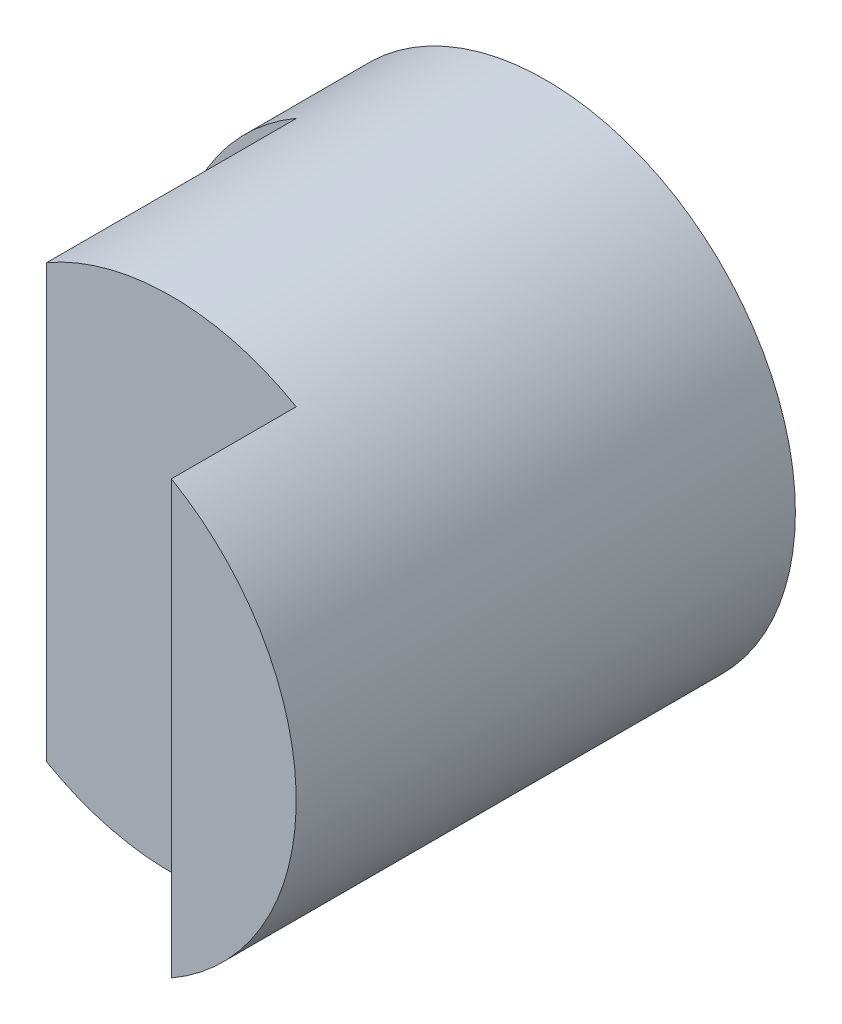
ISO-10303-21;
HEADER;
FILE_DESCRIPTION(('STEP AP214'),'2;1');
FILE_NAME('part.step','',(''),(''),'','','');
FILE_SCHEMA(('AUTOMOTIVE_DESIGN { 1 0 10303 214 1 1 1 1 }'));
ENDSEC;
DATA;
#1=APPLICATION_CONTEXT('core data for automotive mechanical design processes');
#2=APPLICATION_PROTOCOL_DEFINITION('international standard','automotive_design',2000,#1);
#3=PRODUCT_CONTEXT('',#1,'mechanical');
#4=PRODUCT('Part','Part','',(#3));
#5=PRODUCT_RELATED_PRODUCT_CATEGORY('part','',(#4));
#6=PRODUCT_DEFINITION_FORMATION('','',#4);
#7=PRODUCT_DEFINITION_CONTEXT('part definition',#1,'design');
#8=PRODUCT_DEFINITION('design','',#6,#7);
#9=PRODUCT_DEFINITION_SHAPE('','',#8);
#10=(LENGTH_UNIT() NAMED_UNIT(*) SI_UNIT(.MILLI.,.METRE.));
#11=(NAMED_UNIT(*) PLANE_ANGLE_UNIT() SI_UNIT($,.RADIAN.));
#12=(NAMED_UNIT(*) SI_UNIT($,.STERADIAN.) SOLID_ANGLE_UNIT());
#13=UNCERTAINTY_MEASURE_WITH_UNIT(LENGTH_MEASURE(1.E-05),#10,'distance_accuracy_value','');
#14=(GEOMETRIC_REPRESENTATION_CONTEXT(3) GLOBAL_UNCERTAINTY_ASSIGNED_CONTEXT((#13)) GLOBAL_UNIT_ASSIGNED_CONTEXT((#10,
#11,#12)) REPRESENTATION_CONTEXT('',''));
#15=CARTESIAN_POINT('',(0.,0.,0.));
#16=DIRECTION('',(0.,0.,1.));
#17=DIRECTION('',(1.,0.,0.));
#18=AXIS2_PLACEMENT_3D('',#15,#16,#17);
#19=CARTESIAN_POINT('',(0.,0.,4.));
#20=DIRECTION('',(0.,0.,-1.));
#21=DIRECTION('',(-1.,0.,0.));
#22=AXIS2_PLACEMENT_3D('',#19,#20,#21);
#23=CYLINDRICAL_SURFACE('',#22,2.);
#24=CARTESIAN_POINT('',(0.,0.,4.));
#25=DIRECTION('',(0.,0.,1.));
#26=DIRECTION('',(1.,0.,0.));
#27=AXIS2_PLACEMENT_3D('',#24,#25,#26);
#28=CIRCLE('',#27,2.);
#29=CARTESIAN_POINT('',(1.,-1.73205080756888,4.));
#30=VERTEX_POINT('',#29);
#31=CARTESIAN_POINT('',(1.,1.73205080756888,4.));
#32=VERTEX_POINT('',#31);
#33=EDGE_CURVE('E90',#30,#32,#28,.T.);
#34=ORIENTED_EDGE('',*,*,#33,.F.);
#35=DIRECTION('',(0.,0.,-1.));
#36=VECTOR('',#35,1.);
#37=CARTESIAN_POINT('',(1.,-1.73205080756888,4.));
#38=LINE('',#37,#36);
#39=CARTESIAN_POINT('',(1.,-1.73205080756888,3.));
#40=VERTEX_POINT('',#39);
#41=EDGE_CURVE('E47',#30,#40,#38,.T.);
#42=ORIENTED_EDGE('',*,*,#41,.T.);
#43=CARTESIAN_POINT('',(0.,0.,3.));
#44=DIRECTION('',(0.,0.,-1.));
#45=DIRECTION('',(-1.,0.,0.));
#46=AXIS2_PLACEMENT_3D('',#43,#44,#45);
#47=CIRCLE('',#46,2.);
#48=CARTESIAN_POINT('',(-1.,-1.73205080756888,3.));
#49=VERTEX_POINT('',#48);
#50=EDGE_CURVE('E74',#40,#49,#47,.T.);
#51=ORIENTED_EDGE('',*,*,#50,.T.);
#52=DIRECTION('',(0.,0.,-1.));
#53=VECTOR('',#52,1.);
#54=CARTESIAN_POINT('',(-1.,-1.73205080756888,4.));
#55=LINE('',#54,#53);
#56=CARTESIAN_POINT('',(-1.,-1.73205080756888,0.996424706562642));
#57=VERTEX_POINT('',#56);
#58=EDGE_CURVE('E80',#49,#57,#55,.T.);
#59=ORIENTED_EDGE('',*,*,#58,.T.);
#60=CARTESIAN_POINT('',(0.,0.,0.996424706562642));
#61=DIRECTION('',(0.,0.,-1.));
#62=DIRECTION('',(-1.,0.,0.));
#63=AXIS2_PLACEMENT_3D('',#60,#61,#62);
#64=CIRCLE('',#63,2.);
#65=CARTESIAN_POINT('',(-1.,1.73205080756888,0.996424706562642));
#66=VERTEX_POINT('',#65);
#67=EDGE_CURVE('E40',#57,#66,#64,.T.);
#68=ORIENTED_EDGE('',*,*,#67,.T.);
#69=DIRECTION('',(0.,0.,-1.));
#70=VECTOR('',#69,1.);
#71=CARTESIAN_POINT('',(-1.,1.73205080756888,4.));
#72=LINE('',#71,#70);
#73=CARTESIAN_POINT('',(-1.,1.73205080756888,3.));
#74=VERTEX_POINT('',#73);
#75=EDGE_CURVE('E11',#66,#74,#72,.F.);
#76=ORIENTED_EDGE('',*,*,#75,.T.);
#77=CARTESIAN_POINT('',(1.,1.73205080756888,3.));
#78=VERTEX_POINT('',#77);
#79=EDGE_CURVE('E81',#74,#78,#47,.T.);
#80=ORIENTED_EDGE('',*,*,#79,.T.);
#81=DIRECTION('',(0.,0.,-1.));
#82=VECTOR('',#81,1.);
#83=CARTESIAN_POINT('',(1.,1.73205080756888,4.));
#84=LINE('',#83,#82);
#85=EDGE_CURVE('E85',#78,#32,#84,.F.);
#86=ORIENTED_EDGE('',*,*,#85,.T.);
#87=EDGE_LOOP('',(#34,#42,#51,#59,#68,#76,#80,#86));
#88=FACE_BOUND('',#87,.T.);
#89=CARTESIAN_POINT('',(0.,0.,0.));
#90=DIRECTION('',(0.,0.,1.));
#91=DIRECTION('',(1.,0.,0.));
#92=AXIS2_PLACEMENT_3D('',#89,#90,#91);
#93=CIRCLE('',#92,2.);
#94=CARTESIAN_POINT('',(2.,0.,0.));
#95=VERTEX_POINT('',#94);
#96=EDGE_CURVE('E91',#95,#95,#93,.T.);
#97=ORIENTED_EDGE('',*,*,#96,.T.);
#98=EDGE_LOOP('',(#97));
#99=FACE_BOUND('',#98,.T.);
#100=ADVANCED_FACE('F33',(#88,#99),#23,.T.);
#101=CARTESIAN_POINT('',(0.,0.,4.));
#102=DIRECTION('',(0.,0.,1.));
#103=DIRECTION('',(1.,0.,0.));
#104=AXIS2_PLACEMENT_3D('',#101,#102,#103);
#105=PLANE('',#104);
#106=DIRECTION('',(0.,1.,0.));
#107=VECTOR('',#106,1.);
#108=CARTESIAN_POINT('',(1.,0.,4.));
#109=LINE('',#108,#107);
#110=EDGE_CURVE('E98',#30,#32,#109,.T.);
#111=ORIENTED_EDGE('',*,*,#110,.F.);
#112=ORIENTED_EDGE('',*,*,#33,.T.);
#113=EDGE_LOOP('',(#111,#112));
#114=FACE_BOUND('',#113,.T.);
#115=ADVANCED_FACE('F117',(#114),#105,.T.);
#116=CARTESIAN_POINT('',(0.,0.,0.));
#117=DIRECTION('',(0.,0.,1.));
#118=DIRECTION('',(1.,0.,0.));
#119=AXIS2_PLACEMENT_3D('',#116,#117,#118);
#120=PLANE('',#119);
#121=ORIENTED_EDGE('',*,*,#96,.F.);
#122=EDGE_LOOP('',(#121));
#123=FACE_BOUND('',#122,.T.);
#124=ADVANCED_FACE('F110',(#123),#120,.F.);
#125=CARTESIAN_POINT('',(-1.,-2.,0.996424706562642));
#126=DIRECTION('',(0.,0.,-1.));
#127=DIRECTION('',(-1.,0.,0.));
#128=AXIS2_PLACEMENT_3D('',#125,#126,#127);
#129=PLANE('',#128);
#130=ORIENTED_EDGE('',*,*,#67,.F.);
#131=DIRECTION('',(0.,1.,0.));
#132=VECTOR('',#131,1.);
#133=CARTESIAN_POINT('',(-1.,-2.,0.996424706562642));
#134=LINE('',#133,#132);
#135=EDGE_CURVE('E95',#57,#66,#134,.T.);
#136=ORIENTED_EDGE('',*,*,#135,.T.);
#137=EDGE_LOOP('',(#130,#136));
#138=FACE_BOUND('',#137,.T.);
#139=ADVANCED_FACE('F108',(#138),#129,.F.);
#140=CARTESIAN_POINT('',(-1.,-2.,3.));
#141=DIRECTION('',(1.,0.,0.));
#142=DIRECTION('',(0.,0.,-1.));
#143=AXIS2_PLACEMENT_3D('',#140,#141,#142);
#144=PLANE('',#143);
#145=DIRECTION('',(0.,1.,0.));
#146=VECTOR('',#145,1.);
#147=CARTESIAN_POINT('',(-1.,-2.,3.));
#148=LINE('',#147,#146);
#149=EDGE_CURVE('E79',#49,#74,#148,.T.);
#150=ORIENTED_EDGE('',*,*,#149,.T.);
#151=ORIENTED_EDGE('',*,*,#75,.F.);
#152=ORIENTED_EDGE('',*,*,#135,.F.);
#153=ORIENTED_EDGE('',*,*,#58,.F.);
#154=EDGE_LOOP('',(#150,#151,#152,#153));
#155=FACE_BOUND('',#154,.T.);
#156=ADVANCED_FACE('F103',(#155),#144,.F.);
#157=CARTESIAN_POINT('',(-1.,-2.,3.));
#158=DIRECTION('',(0.,0.,-1.));
#159=DIRECTION('',(-1.,0.,0.));
#160=AXIS2_PLACEMENT_3D('',#157,#158,#159);
#161=PLANE('',#160);
#162=ORIENTED_EDGE('',*,*,#149,.F.);
#163=ORIENTED_EDGE('',*,*,#50,.F.);
#164=DIRECTION('',(0.,1.,0.));
#165=VECTOR('',#164,1.);
#166=CARTESIAN_POINT('',(1.,-2.,3.));
#167=LINE('',#166,#165);
#168=EDGE_CURVE('E76',#40,#78,#167,.T.);
#169=ORIENTED_EDGE('',*,*,#168,.T.);
#170=ORIENTED_EDGE('',*,*,#79,.F.);
#171=EDGE_LOOP('',(#162,#163,#169,#170));
#172=FACE_BOUND('',#171,.T.);
#173=ADVANCED_FACE('F75',(#172),#161,.F.);
#174=CARTESIAN_POINT('',(1.,-2.,5.));
#175=DIRECTION('',(1.,0.,0.));
#176=DIRECTION('',(0.,0.,-1.));
#177=AXIS2_PLACEMENT_3D('',#174,#175,#176);
#178=PLANE('',#177);
#179=ORIENTED_EDGE('',*,*,#110,.T.);
#180=ORIENTED_EDGE('',*,*,#85,.F.);
#181=ORIENTED_EDGE('',*,*,#168,.F.);
#182=ORIENTED_EDGE('',*,*,#41,.F.);
#183=EDGE_LOOP('',(#179,#180,#181,#182));
#184=FACE_BOUND('',#183,.T.);
#185=ADVANCED_FACE('F83',(#184),#178,.F.);
#186=CLOSED_SHELL('',(#100,#115,#124,#139,#156,#173,#185));
#187=MANIFOLD_SOLID_BREP('B2',#186);
#188=ADVANCED_BREP_SHAPE_REPRESENTATION('',(#18,#187),#14);
#189=SHAPE_DEFINITION_REPRESENTATION(#9,#188);
ENDSEC;
END-ISO-10303-21;
